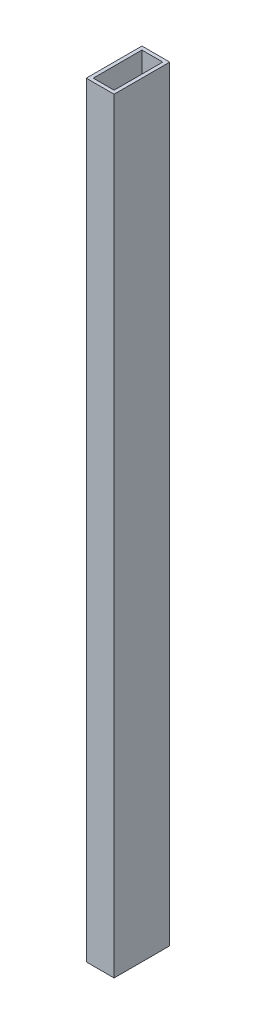
ISO-10303-21;
HEADER;
FILE_DESCRIPTION(('STEP AP214'),'2;1');
FILE_NAME('part.step','',(''),(''),'','','');
FILE_SCHEMA(('AUTOMOTIVE_DESIGN { 1 0 10303 214 1 1 1 1 }'));
ENDSEC;
DATA;
#1=APPLICATION_CONTEXT('core data for automotive mechanical design processes');
#2=APPLICATION_PROTOCOL_DEFINITION('international standard','automotive_design',2000,#1);
#3=PRODUCT_CONTEXT('',#1,'mechanical');
#4=PRODUCT('Part','Part','',(#3));
#5=PRODUCT_RELATED_PRODUCT_CATEGORY('part','',(#4));
#6=PRODUCT_DEFINITION_FORMATION('','',#4);
#7=PRODUCT_DEFINITION_CONTEXT('part definition',#1,'design');
#8=PRODUCT_DEFINITION('design','',#6,#7);
#9=PRODUCT_DEFINITION_SHAPE('','',#8);
#10=(LENGTH_UNIT() NAMED_UNIT(*) SI_UNIT(.MILLI.,.METRE.));
#11=(NAMED_UNIT(*) PLANE_ANGLE_UNIT() SI_UNIT($,.RADIAN.));
#12=(NAMED_UNIT(*) SI_UNIT($,.STERADIAN.) SOLID_ANGLE_UNIT());
#13=UNCERTAINTY_MEASURE_WITH_UNIT(LENGTH_MEASURE(1.E-05),#10,'distance_accuracy_value','');
#14=(GEOMETRIC_REPRESENTATION_CONTEXT(3) GLOBAL_UNCERTAINTY_ASSIGNED_CONTEXT((#13)) GLOBAL_UNIT_ASSIGNED_CONTEXT((#10,
#11,#12)) REPRESENTATION_CONTEXT('',''));
#15=CARTESIAN_POINT('',(0.,0.,0.));
#16=DIRECTION('',(0.,0.,1.));
#17=DIRECTION('',(1.,0.,0.));
#18=AXIS2_PLACEMENT_3D('',#15,#16,#17);
#19=CARTESIAN_POINT('',(0.,698.5,0.));
#20=DIRECTION('',(0.,-1.,0.));
#21=DIRECTION('',(0.,0.,-1.));
#22=AXIS2_PLACEMENT_3D('',#19,#20,#21);
#23=PLANE('',#22);
#24=DIRECTION('',(0.,0.,1.));
#25=VECTOR('',#24,1.);
#26=CARTESIAN_POINT('',(0.,698.5,0.));
#27=LINE('',#26,#25);
#28=CARTESIAN_POINT('',(0.,698.5,-50.8));
#29=VERTEX_POINT('',#28);
#30=CARTESIAN_POINT('',(0.,698.5,0.));
#31=VERTEX_POINT('',#30);
#32=EDGE_CURVE('E141',#29,#31,#27,.T.);
#33=ORIENTED_EDGE('',*,*,#32,.T.);
#34=DIRECTION('',(1.,0.,0.));
#35=VECTOR('',#34,1.);
#36=CARTESIAN_POINT('',(0.,698.5,0.));
#37=LINE('',#36,#35);
#38=CARTESIAN_POINT('',(25.4,698.5,0.));
#39=VERTEX_POINT('',#38);
#40=EDGE_CURVE('E144',#31,#39,#37,.T.);
#41=ORIENTED_EDGE('',*,*,#40,.T.);
#42=DIRECTION('',(0.,0.,-1.));
#43=VECTOR('',#42,1.);
#44=CARTESIAN_POINT('',(25.4,698.5,0.));
#45=LINE('',#44,#43);
#46=CARTESIAN_POINT('',(25.4,698.5,-50.8));
#47=VERTEX_POINT('',#46);
#48=EDGE_CURVE('E147',#39,#47,#45,.T.);
#49=ORIENTED_EDGE('',*,*,#48,.T.);
#50=DIRECTION('',(-1.,0.,0.));
#51=VECTOR('',#50,1.);
#52=CARTESIAN_POINT('',(0.,698.5,-50.8));
#53=LINE('',#52,#51);
#54=EDGE_CURVE('E149',#47,#29,#53,.T.);
#55=ORIENTED_EDGE('',*,*,#54,.T.);
#56=EDGE_LOOP('',(#33,#41,#49,#55));
#57=FACE_BOUND('',#56,.T.);
#58=DIRECTION('',(0.,0.,1.));
#59=VECTOR('',#58,1.);
#60=CARTESIAN_POINT('',(3.175,698.5,-3.175));
#61=LINE('',#60,#59);
#62=CARTESIAN_POINT('',(3.175,698.5,-47.625));
#63=VERTEX_POINT('',#62);
#64=CARTESIAN_POINT('',(3.175,698.5,-3.175));
#65=VERTEX_POINT('',#64);
#66=EDGE_CURVE('E105',#63,#65,#61,.T.);
#67=ORIENTED_EDGE('',*,*,#66,.F.);
#68=DIRECTION('',(-1.,0.,0.));
#69=VECTOR('',#68,1.);
#70=CARTESIAN_POINT('',(3.175,698.5,-47.625));
#71=LINE('',#70,#69);
#72=CARTESIAN_POINT('',(22.225,698.5,-47.625));
#73=VERTEX_POINT('',#72);
#74=EDGE_CURVE('E127',#73,#63,#71,.T.);
#75=ORIENTED_EDGE('',*,*,#74,.F.);
#76=DIRECTION('',(0.,0.,-1.));
#77=VECTOR('',#76,1.);
#78=CARTESIAN_POINT('',(22.225,698.5,-3.175));
#79=LINE('',#78,#77);
#80=CARTESIAN_POINT('',(22.225,698.5,-3.175));
#81=VERTEX_POINT('',#80);
#82=EDGE_CURVE('E125',#81,#73,#79,.T.);
#83=ORIENTED_EDGE('',*,*,#82,.F.);
#84=DIRECTION('',(1.,0.,0.));
#85=VECTOR('',#84,1.);
#86=CARTESIAN_POINT('',(3.175,698.5,-3.175));
#87=LINE('',#86,#85);
#88=EDGE_CURVE('E113',#65,#81,#87,.T.);
#89=ORIENTED_EDGE('',*,*,#88,.F.);
#90=EDGE_LOOP('',(#67,#75,#83,#89));
#91=FACE_BOUND('',#90,.T.);
#92=ADVANCED_FACE('F40',(#57,#91),#23,.F.);
#93=CARTESIAN_POINT('',(0.,0.,0.));
#94=DIRECTION('',(0.,-1.,0.));
#95=DIRECTION('',(0.,0.,-1.));
#96=AXIS2_PLACEMENT_3D('',#93,#94,#95);
#97=PLANE('',#96);
#98=DIRECTION('',(0.,0.,1.));
#99=VECTOR('',#98,1.);
#100=CARTESIAN_POINT('',(0.,0.,0.));
#101=LINE('',#100,#99);
#102=CARTESIAN_POINT('',(0.,0.,-50.8));
#103=VERTEX_POINT('',#102);
#104=CARTESIAN_POINT('',(0.,0.,0.));
#105=VERTEX_POINT('',#104);
#106=EDGE_CURVE('E121',#103,#105,#101,.T.);
#107=ORIENTED_EDGE('',*,*,#106,.F.);
#108=DIRECTION('',(-1.,0.,0.));
#109=VECTOR('',#108,1.);
#110=CARTESIAN_POINT('',(0.,0.,-50.8));
#111=LINE('',#110,#109);
#112=CARTESIAN_POINT('',(25.4,0.,-50.8));
#113=VERTEX_POINT('',#112);
#114=EDGE_CURVE('E145',#113,#103,#111,.T.);
#115=ORIENTED_EDGE('',*,*,#114,.F.);
#116=DIRECTION('',(0.,0.,-1.));
#117=VECTOR('',#116,1.);
#118=CARTESIAN_POINT('',(25.4,0.,0.));
#119=LINE('',#118,#117);
#120=CARTESIAN_POINT('',(25.4,0.,0.));
#121=VERTEX_POINT('',#120);
#122=EDGE_CURVE('E156',#121,#113,#119,.T.);
#123=ORIENTED_EDGE('',*,*,#122,.F.);
#124=DIRECTION('',(1.,0.,0.));
#125=VECTOR('',#124,1.);
#126=CARTESIAN_POINT('',(0.,0.,0.));
#127=LINE('',#126,#125);
#128=EDGE_CURVE('E154',#105,#121,#127,.T.);
#129=ORIENTED_EDGE('',*,*,#128,.F.);
#130=EDGE_LOOP('',(#107,#115,#123,#129));
#131=FACE_BOUND('',#130,.T.);
#132=DIRECTION('',(-1.,0.,0.));
#133=VECTOR('',#132,1.);
#134=CARTESIAN_POINT('',(3.175,0.,-47.625));
#135=LINE('',#134,#133);
#136=CARTESIAN_POINT('',(22.225,0.,-47.625));
#137=VERTEX_POINT('',#136);
#138=CARTESIAN_POINT('',(3.175,0.,-47.625));
#139=VERTEX_POINT('',#138);
#140=EDGE_CURVE('E114',#137,#139,#135,.T.);
#141=ORIENTED_EDGE('',*,*,#140,.T.);
#142=DIRECTION('',(0.,0.,1.));
#143=VECTOR('',#142,1.);
#144=CARTESIAN_POINT('',(3.175,0.,-3.175));
#145=LINE('',#144,#143);
#146=CARTESIAN_POINT('',(3.175,0.,-3.175));
#147=VERTEX_POINT('',#146);
#148=EDGE_CURVE('E63',#139,#147,#145,.T.);
#149=ORIENTED_EDGE('',*,*,#148,.T.);
#150=DIRECTION('',(1.,0.,0.));
#151=VECTOR('',#150,1.);
#152=CARTESIAN_POINT('',(3.175,0.,-3.175));
#153=LINE('',#152,#151);
#154=CARTESIAN_POINT('',(22.225,0.,-3.175));
#155=VERTEX_POINT('',#154);
#156=EDGE_CURVE('E120',#147,#155,#153,.T.);
#157=ORIENTED_EDGE('',*,*,#156,.T.);
#158=DIRECTION('',(0.,0.,-1.));
#159=VECTOR('',#158,1.);
#160=CARTESIAN_POINT('',(22.225,0.,-3.175));
#161=LINE('',#160,#159);
#162=EDGE_CURVE('E133',#155,#137,#161,.T.);
#163=ORIENTED_EDGE('',*,*,#162,.T.);
#164=EDGE_LOOP('',(#141,#149,#157,#163));
#165=FACE_BOUND('',#164,.T.);
#166=ADVANCED_FACE('F174',(#131,#165),#97,.T.);
#167=CARTESIAN_POINT('',(0.,698.5,0.));
#168=DIRECTION('',(1.,0.,0.));
#169=DIRECTION('',(0.,0.,-1.));
#170=AXIS2_PLACEMENT_3D('',#167,#168,#169);
#171=PLANE('',#170);
#172=ORIENTED_EDGE('',*,*,#106,.T.);
#173=DIRECTION('',(0.,-1.,0.));
#174=VECTOR('',#173,1.);
#175=CARTESIAN_POINT('',(0.,698.5,0.));
#176=LINE('',#175,#174);
#177=EDGE_CURVE('E11',#31,#105,#176,.T.);
#178=ORIENTED_EDGE('',*,*,#177,.F.);
#179=ORIENTED_EDGE('',*,*,#32,.F.);
#180=DIRECTION('',(0.,-1.,0.));
#181=VECTOR('',#180,1.);
#182=CARTESIAN_POINT('',(0.,698.5,-50.8));
#183=LINE('',#182,#181);
#184=EDGE_CURVE('E151',#29,#103,#183,.T.);
#185=ORIENTED_EDGE('',*,*,#184,.T.);
#186=EDGE_LOOP('',(#172,#178,#179,#185));
#187=FACE_BOUND('',#186,.T.);
#188=ADVANCED_FACE('F42',(#187),#171,.F.);
#189=CARTESIAN_POINT('',(0.,698.5,0.));
#190=DIRECTION('',(0.,0.,-1.));
#191=DIRECTION('',(-1.,0.,0.));
#192=AXIS2_PLACEMENT_3D('',#189,#190,#191);
#193=PLANE('',#192);
#194=ORIENTED_EDGE('',*,*,#128,.T.);
#195=DIRECTION('',(0.,-1.,0.));
#196=VECTOR('',#195,1.);
#197=CARTESIAN_POINT('',(25.4,698.5,0.));
#198=LINE('',#197,#196);
#199=EDGE_CURVE('E48',#39,#121,#198,.T.);
#200=ORIENTED_EDGE('',*,*,#199,.F.);
#201=ORIENTED_EDGE('',*,*,#40,.F.);
#202=ORIENTED_EDGE('',*,*,#177,.T.);
#203=EDGE_LOOP('',(#194,#200,#201,#202));
#204=FACE_BOUND('',#203,.T.);
#205=ADVANCED_FACE('F184',(#204),#193,.F.);
#206=CARTESIAN_POINT('',(25.4,698.5,0.));
#207=DIRECTION('',(-1.,0.,0.));
#208=DIRECTION('',(0.,0.,1.));
#209=AXIS2_PLACEMENT_3D('',#206,#207,#208);
#210=PLANE('',#209);
#211=ORIENTED_EDGE('',*,*,#122,.T.);
#212=DIRECTION('',(0.,-1.,0.));
#213=VECTOR('',#212,1.);
#214=CARTESIAN_POINT('',(25.4,698.5,-50.8));
#215=LINE('',#214,#213);
#216=EDGE_CURVE('E161',#47,#113,#215,.T.);
#217=ORIENTED_EDGE('',*,*,#216,.F.);
#218=ORIENTED_EDGE('',*,*,#48,.F.);
#219=ORIENTED_EDGE('',*,*,#199,.T.);
#220=EDGE_LOOP('',(#211,#217,#218,#219));
#221=FACE_BOUND('',#220,.T.);
#222=ADVANCED_FACE('F168',(#221),#210,.F.);
#223=CARTESIAN_POINT('',(0.,698.5,-50.8));
#224=DIRECTION('',(0.,0.,1.));
#225=DIRECTION('',(1.,0.,0.));
#226=AXIS2_PLACEMENT_3D('',#223,#224,#225);
#227=PLANE('',#226);
#228=ORIENTED_EDGE('',*,*,#114,.T.);
#229=ORIENTED_EDGE('',*,*,#184,.F.);
#230=ORIENTED_EDGE('',*,*,#54,.F.);
#231=ORIENTED_EDGE('',*,*,#216,.T.);
#232=EDGE_LOOP('',(#228,#229,#230,#231));
#233=FACE_BOUND('',#232,.T.);
#234=ADVANCED_FACE('F178',(#233),#227,.F.);
#235=CARTESIAN_POINT('',(3.175,698.5,-3.175));
#236=DIRECTION('',(1.,0.,0.));
#237=DIRECTION('',(0.,0.,-1.));
#238=AXIS2_PLACEMENT_3D('',#235,#236,#237);
#239=PLANE('',#238);
#240=ORIENTED_EDGE('',*,*,#148,.F.);
#241=DIRECTION('',(0.,-1.,0.));
#242=VECTOR('',#241,1.);
#243=CARTESIAN_POINT('',(3.175,698.5,-47.625));
#244=LINE('',#243,#242);
#245=EDGE_CURVE('E109',#63,#139,#244,.T.);
#246=ORIENTED_EDGE('',*,*,#245,.F.);
#247=ORIENTED_EDGE('',*,*,#66,.T.);
#248=DIRECTION('',(0.,-1.,0.));
#249=VECTOR('',#248,1.);
#250=CARTESIAN_POINT('',(3.175,698.5,-3.175));
#251=LINE('',#250,#249);
#252=EDGE_CURVE('E108',#65,#147,#251,.T.);
#253=ORIENTED_EDGE('',*,*,#252,.T.);
#254=EDGE_LOOP('',(#240,#246,#247,#253));
#255=FACE_BOUND('',#254,.T.);
#256=ADVANCED_FACE('F107',(#255),#239,.T.);
#257=CARTESIAN_POINT('',(3.175,698.5,-3.175));
#258=DIRECTION('',(0.,0.,-1.));
#259=DIRECTION('',(-1.,0.,0.));
#260=AXIS2_PLACEMENT_3D('',#257,#258,#259);
#261=PLANE('',#260);
#262=ORIENTED_EDGE('',*,*,#156,.F.);
#263=ORIENTED_EDGE('',*,*,#252,.F.);
#264=ORIENTED_EDGE('',*,*,#88,.T.);
#265=DIRECTION('',(0.,-1.,0.));
#266=VECTOR('',#265,1.);
#267=CARTESIAN_POINT('',(22.225,698.5,-3.175));
#268=LINE('',#267,#266);
#269=EDGE_CURVE('E122',#81,#155,#268,.T.);
#270=ORIENTED_EDGE('',*,*,#269,.T.);
#271=EDGE_LOOP('',(#262,#263,#264,#270));
#272=FACE_BOUND('',#271,.T.);
#273=ADVANCED_FACE('F117',(#272),#261,.T.);
#274=CARTESIAN_POINT('',(22.225,698.5,-3.175));
#275=DIRECTION('',(-1.,0.,0.));
#276=DIRECTION('',(0.,0.,1.));
#277=AXIS2_PLACEMENT_3D('',#274,#275,#276);
#278=PLANE('',#277);
#279=ORIENTED_EDGE('',*,*,#162,.F.);
#280=ORIENTED_EDGE('',*,*,#269,.F.);
#281=ORIENTED_EDGE('',*,*,#82,.T.);
#282=DIRECTION('',(0.,-1.,0.));
#283=VECTOR('',#282,1.);
#284=CARTESIAN_POINT('',(22.225,698.5,-47.625));
#285=LINE('',#284,#283);
#286=EDGE_CURVE('E55',#73,#137,#285,.T.);
#287=ORIENTED_EDGE('',*,*,#286,.T.);
#288=EDGE_LOOP('',(#279,#280,#281,#287));
#289=FACE_BOUND('',#288,.T.);
#290=ADVANCED_FACE('F207',(#289),#278,.T.);
#291=CARTESIAN_POINT('',(3.175,698.5,-47.625));
#292=DIRECTION('',(0.,0.,1.));
#293=DIRECTION('',(1.,0.,0.));
#294=AXIS2_PLACEMENT_3D('',#291,#292,#293);
#295=PLANE('',#294);
#296=ORIENTED_EDGE('',*,*,#140,.F.);
#297=ORIENTED_EDGE('',*,*,#286,.F.);
#298=ORIENTED_EDGE('',*,*,#74,.T.);
#299=ORIENTED_EDGE('',*,*,#245,.T.);
#300=EDGE_LOOP('',(#296,#297,#298,#299));
#301=FACE_BOUND('',#300,.T.);
#302=ADVANCED_FACE('F211',(#301),#295,.T.);
#303=CLOSED_SHELL('',(#92,#166,#188,#205,#222,#234,#256,#273,#290,#302));
#304=MANIFOLD_SOLID_BREP('B2',#303);
#305=ADVANCED_BREP_SHAPE_REPRESENTATION('',(#18,#304),#14);
#306=SHAPE_DEFINITION_REPRESENTATION(#9,#305);
ENDSEC;
END-ISO-10303-21;
